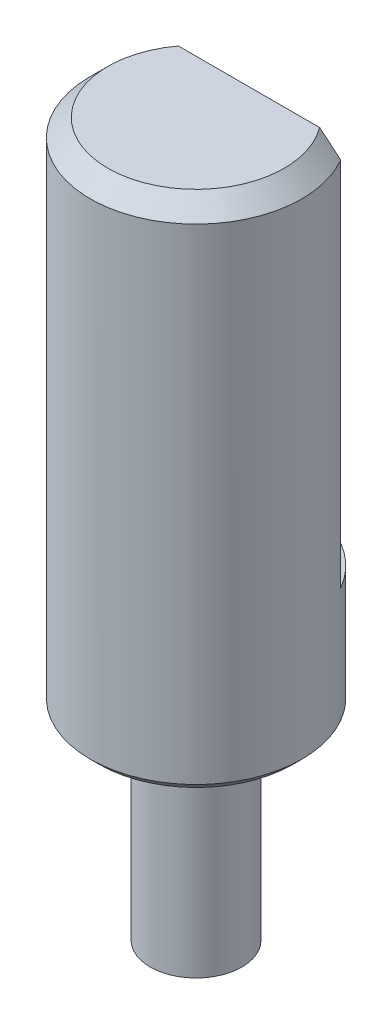
ISO-10303-21;
HEADER;
FILE_DESCRIPTION(('STEP AP214'),'2;1');
FILE_NAME('part.step','',(''),(''),'','','');
FILE_SCHEMA(('AUTOMOTIVE_DESIGN { 1 0 10303 214 1 1 1 1 }'));
ENDSEC;
DATA;
#1=APPLICATION_CONTEXT('core data for automotive mechanical design processes');
#2=APPLICATION_PROTOCOL_DEFINITION('international standard','automotive_design',2000,#1);
#3=PRODUCT_CONTEXT('',#1,'mechanical');
#4=PRODUCT('Part','Part','',(#3));
#5=PRODUCT_RELATED_PRODUCT_CATEGORY('part','',(#4));
#6=PRODUCT_DEFINITION_FORMATION('','',#4);
#7=PRODUCT_DEFINITION_CONTEXT('part definition',#1,'design');
#8=PRODUCT_DEFINITION('design','',#6,#7);
#9=PRODUCT_DEFINITION_SHAPE('','',#8);
#10=(LENGTH_UNIT() NAMED_UNIT(*) SI_UNIT(.MILLI.,.METRE.));
#11=(NAMED_UNIT(*) PLANE_ANGLE_UNIT() SI_UNIT($,.RADIAN.));
#12=(NAMED_UNIT(*) SI_UNIT($,.STERADIAN.) SOLID_ANGLE_UNIT());
#13=UNCERTAINTY_MEASURE_WITH_UNIT(LENGTH_MEASURE(1.E-05),#10,'distance_accuracy_value','');
#14=(GEOMETRIC_REPRESENTATION_CONTEXT(3) GLOBAL_UNCERTAINTY_ASSIGNED_CONTEXT((#13)) GLOBAL_UNIT_ASSIGNED_CONTEXT((#10,
#11,#12)) REPRESENTATION_CONTEXT('',''));
#15=CARTESIAN_POINT('',(0.,0.,0.));
#16=DIRECTION('',(0.,0.,1.));
#17=DIRECTION('',(1.,0.,0.));
#18=AXIS2_PLACEMENT_3D('',#15,#16,#17);
#19=CARTESIAN_POINT('',(0.,5.7,0.));
#20=DIRECTION('',(0.,-1.,0.));
#21=DIRECTION('',(0.,0.,-1.));
#22=AXIS2_PLACEMENT_3D('',#19,#20,#21);
#23=CYLINDRICAL_SURFACE('',#22,1.3);
#24=CARTESIAN_POINT('',(0.,5.7,0.));
#25=DIRECTION('',(0.,1.,0.));
#26=DIRECTION('',(0.,0.,1.));
#27=AXIS2_PLACEMENT_3D('',#24,#25,#26);
#28=CIRCLE('',#27,1.3);
#29=CARTESIAN_POINT('',(0.,5.7,1.3));
#30=VERTEX_POINT('',#29);
#31=EDGE_CURVE('E96',#30,#30,#28,.T.);
#32=ORIENTED_EDGE('',*,*,#31,.F.);
#33=EDGE_LOOP('',(#32));
#34=FACE_BOUND('',#33,.T.);
#35=CARTESIAN_POINT('',(0.,0.,0.));
#36=DIRECTION('',(0.,1.,0.));
#37=DIRECTION('',(0.,0.,1.));
#38=AXIS2_PLACEMENT_3D('',#35,#36,#37);
#39=CIRCLE('',#38,1.3);
#40=CARTESIAN_POINT('',(0.,0.,1.3));
#41=VERTEX_POINT('',#40);
#42=EDGE_CURVE('E92',#41,#41,#39,.T.);
#43=ORIENTED_EDGE('',*,*,#42,.T.);
#44=EDGE_LOOP('',(#43));
#45=FACE_BOUND('',#44,.T.);
#46=ADVANCED_FACE('F44',(#34,#45),#23,.T.);
#47=CARTESIAN_POINT('',(0.,0.,0.));
#48=DIRECTION('',(0.,1.,0.));
#49=DIRECTION('',(0.,0.,1.));
#50=AXIS2_PLACEMENT_3D('',#47,#48,#49);
#51=PLANE('',#50);
#52=ORIENTED_EDGE('',*,*,#42,.F.);
#53=EDGE_LOOP('',(#52));
#54=FACE_BOUND('',#53,.T.);
#55=ADVANCED_FACE('F136',(#54),#51,.F.);
#56=CARTESIAN_POINT('',(0.,20.2,0.));
#57=DIRECTION('',(0.,-1.,0.));
#58=DIRECTION('',(0.,0.,-1.));
#59=AXIS2_PLACEMENT_3D('',#56,#57,#58);
#60=CYLINDRICAL_SURFACE('',#59,3.);
#61=DIRECTION('',(0.,1.,0.));
#62=VECTOR('',#61,1.);
#63=CARTESIAN_POINT('',(2.59807621135332,9.2,-1.5));
#64=LINE('',#63,#62);
#65=CARTESIAN_POINT('',(2.59807621135332,9.2,-1.5));
#66=VERTEX_POINT('',#65);
#67=CARTESIAN_POINT('',(2.59807621135332,19.7,-1.5));
#68=VERTEX_POINT('',#67);
#69=EDGE_CURVE('E87',#66,#68,#64,.T.);
#70=ORIENTED_EDGE('',*,*,#69,.T.);
#71=CARTESIAN_POINT('',(0.,19.7,0.));
#72=DIRECTION('',(0.,1.,0.));
#73=DIRECTION('',(0.,0.,1.));
#74=AXIS2_PLACEMENT_3D('',#71,#72,#73);
#75=CIRCLE('',#74,3.);
#76=CARTESIAN_POINT('',(-2.59807621135332,19.7,-1.5));
#77=VERTEX_POINT('',#76);
#78=EDGE_CURVE('E13',#68,#77,#75,.F.);
#79=ORIENTED_EDGE('',*,*,#78,.T.);
#80=DIRECTION('',(0.,1.,0.));
#81=VECTOR('',#80,1.);
#82=CARTESIAN_POINT('',(-2.59807621135332,9.2,-1.5));
#83=LINE('',#82,#81);
#84=CARTESIAN_POINT('',(-2.59807621135332,9.2,-1.5));
#85=VERTEX_POINT('',#84);
#86=EDGE_CURVE('E85',#85,#77,#83,.T.);
#87=ORIENTED_EDGE('',*,*,#86,.F.);
#88=CARTESIAN_POINT('',(0.,9.2,0.));
#89=DIRECTION('',(0.,1.,0.));
#90=DIRECTION('',(0.,0.,1.));
#91=AXIS2_PLACEMENT_3D('',#88,#89,#90);
#92=CIRCLE('',#91,3.);
#93=EDGE_CURVE('E78',#66,#85,#92,.T.);
#94=ORIENTED_EDGE('',*,*,#93,.F.);
#95=EDGE_LOOP('',(#70,#79,#87,#94));
#96=FACE_BOUND('',#95,.T.);
#97=CARTESIAN_POINT('',(0.,5.95000000000001,0.));
#98=DIRECTION('',(0.,1.,0.));
#99=DIRECTION('',(0.,0.,1.));
#100=AXIS2_PLACEMENT_3D('',#97,#98,#99);
#101=CIRCLE('',#100,3.);
#102=CARTESIAN_POINT('',(0.,5.95000000000001,3.));
#103=VERTEX_POINT('',#102);
#104=EDGE_CURVE('E99',#103,#103,#101,.T.);
#105=ORIENTED_EDGE('',*,*,#104,.T.);
#106=EDGE_LOOP('',(#105));
#107=FACE_BOUND('',#106,.T.);
#108=ADVANCED_FACE('F89',(#96,#107),#60,.T.);
#109=CARTESIAN_POINT('',(0.,20.2,0.));
#110=DIRECTION('',(0.,1.,0.));
#111=DIRECTION('',(0.,0.,1.));
#112=AXIS2_PLACEMENT_3D('',#109,#110,#111);
#113=PLANE('',#112);
#114=DIRECTION('',(1.,0.,0.));
#115=VECTOR('',#114,1.);
#116=CARTESIAN_POINT('',(-2.59807621135332,20.2,-1.5));
#117=LINE('',#116,#115);
#118=CARTESIAN_POINT('',(-2.00000000000001,20.2,-1.5));
#119=VERTEX_POINT('',#118);
#120=CARTESIAN_POINT('',(2.00000000000001,20.2,-1.5));
#121=VERTEX_POINT('',#120);
#122=EDGE_CURVE('E82',#119,#121,#117,.T.);
#123=ORIENTED_EDGE('',*,*,#122,.F.);
#124=CARTESIAN_POINT('',(0.,20.2,0.));
#125=DIRECTION('',(0.,1.,0.));
#126=DIRECTION('',(0.,0.,1.));
#127=AXIS2_PLACEMENT_3D('',#124,#125,#126);
#128=CIRCLE('',#127,2.50000000000001);
#129=EDGE_CURVE('E107',#119,#121,#128,.T.);
#130=ORIENTED_EDGE('',*,*,#129,.T.);
#131=EDGE_LOOP('',(#123,#130));
#132=FACE_BOUND('',#131,.T.);
#133=ADVANCED_FACE('F125',(#132),#113,.T.);
#134=CARTESIAN_POINT('',(0.,5.7,0.));
#135=DIRECTION('',(0.,1.,0.));
#136=DIRECTION('',(0.,0.,1.));
#137=AXIS2_PLACEMENT_3D('',#134,#135,#136);
#138=PLANE('',#137);
#139=CARTESIAN_POINT('',(0.,5.7,0.));
#140=DIRECTION('',(0.,1.,0.));
#141=DIRECTION('',(0.,0.,1.));
#142=AXIS2_PLACEMENT_3D('',#139,#140,#141);
#143=CIRCLE('',#142,2.74999999999999);
#144=CARTESIAN_POINT('',(0.,5.7,2.74999999999999));
#145=VERTEX_POINT('',#144);
#146=EDGE_CURVE('E104',#145,#145,#143,.F.);
#147=ORIENTED_EDGE('',*,*,#146,.T.);
#148=EDGE_LOOP('',(#147));
#149=FACE_BOUND('',#148,.T.);
#150=ORIENTED_EDGE('',*,*,#31,.T.);
#151=EDGE_LOOP('',(#150));
#152=FACE_BOUND('',#151,.T.);
#153=ADVANCED_FACE('F129',(#149,#152),#138,.F.);
#154=CARTESIAN_POINT('',(0.,5.95000000000001,0.));
#155=DIRECTION('',(0.,1.,0.));
#156=DIRECTION('',(0.,0.,1.));
#157=AXIS2_PLACEMENT_3D('',#154,#155,#156);
#158=CONICAL_SURFACE('',#157,3.,0.785398163397448);
#159=ORIENTED_EDGE('',*,*,#146,.F.);
#160=EDGE_LOOP('',(#159));
#161=FACE_BOUND('',#160,.T.);
#162=ORIENTED_EDGE('',*,*,#104,.F.);
#163=EDGE_LOOP('',(#162));
#164=FACE_BOUND('',#163,.T.);
#165=ADVANCED_FACE('F124',(#161,#164),#158,.T.);
#166=CARTESIAN_POINT('',(-2.59807621135332,9.2,-1.5));
#167=DIRECTION('',(0.,0.,1.));
#168=DIRECTION('',(1.,0.,0.));
#169=AXIS2_PLACEMENT_3D('',#166,#167,#168);
#170=PLANE('',#169);
#171=ORIENTED_EDGE('',*,*,#122,.T.);
#172=CARTESIAN_POINT('',(2.00000000000001,20.2,-1.5));
#173=CARTESIAN_POINT('',(2.05073096834371,20.1594091541126,-1.5));
#174=CARTESIAN_POINT('',(2.10119559346293,20.1184877796223,-1.5));
#175=CARTESIAN_POINT('',(2.20165596476533,20.0360826364181,-1.5));
#176=CARTESIAN_POINT('',(2.25165175427951,19.9945989205613,-1.5));
#177=CARTESIAN_POINT('',(2.35124649520412,19.9111611597559,-1.5));
#178=CARTESIAN_POINT('',(2.40084545624944,19.8692071262861,-1.5));
#179=CARTESIAN_POINT('',(2.49970382878964,19.7848914399475,-1.5));
#180=CARTESIAN_POINT('',(2.54896320821956,19.7425297494666,-1.5));
#181=CARTESIAN_POINT('',(2.59807621135341,19.7000000000001,-1.5));
#182=B_SPLINE_CURVE_WITH_KNOTS('',3,(#172,#173,#174,#175,#176,#177,#178,#179,#180,#181),
.UNSPECIFIED.,.F.,.F.,(4,2,2,2,4),(0.,0.194909899355778,0.38980160348904,0.584688561258781,
0.779593675856239),.UNSPECIFIED.);
#183=EDGE_CURVE('E53',#121,#68,#182,.T.);
#184=ORIENTED_EDGE('',*,*,#183,.T.);
#185=ORIENTED_EDGE('',*,*,#69,.F.);
#186=DIRECTION('',(1.,0.,0.));
#187=VECTOR('',#186,1.);
#188=CARTESIAN_POINT('',(-2.59807621135332,9.2,-1.5));
#189=LINE('',#188,#187);
#190=EDGE_CURVE('E81',#85,#66,#189,.T.);
#191=ORIENTED_EDGE('',*,*,#190,.F.);
#192=ORIENTED_EDGE('',*,*,#86,.T.);
#193=CARTESIAN_POINT('',(-2.59807621135332,19.7,-1.5));
#194=CARTESIAN_POINT('',(-2.54896320821952,19.7425297494665,-1.5));
#195=CARTESIAN_POINT('',(-2.49970382878963,19.7848914399475,-1.5));
#196=CARTESIAN_POINT('',(-2.40084545624945,19.8692071262861,-1.5));
#197=CARTESIAN_POINT('',(-2.35124649520413,19.9111611597559,-1.5));
#198=CARTESIAN_POINT('',(-2.2516517542795,19.9945989205613,-1.5));
#199=CARTESIAN_POINT('',(-2.20165596476531,20.036082636418,-1.5));
#200=CARTESIAN_POINT('',(-2.10119559346297,20.1184877796224,-1.5));
#201=CARTESIAN_POINT('',(-2.05073096834384,20.1594091541128,-1.5));
#202=CARTESIAN_POINT('',(-2.00000000000032,20.2000000000004,-1.5));
#203=B_SPLINE_CURVE_WITH_KNOTS('',3,(#193,#194,#195,#196,#197,#198,#199,#200,#201,#202),
.UNSPECIFIED.,.F.,.F.,(4,2,2,2,4),(0.,0.194905114597462,0.389792072367198,0.584683776500454,
0.779593675856229),.UNSPECIFIED.);
#204=EDGE_CURVE('E110',#77,#119,#203,.T.);
#205=ORIENTED_EDGE('',*,*,#204,.T.);
#206=EDGE_LOOP('',(#171,#184,#185,#191,#192,#205));
#207=FACE_BOUND('',#206,.T.);
#208=ADVANCED_FACE('F84',(#207),#170,.F.);
#209=CARTESIAN_POINT('',(0.,9.2,0.));
#210=DIRECTION('',(0.,1.,0.));
#211=DIRECTION('',(0.,0.,1.));
#212=AXIS2_PLACEMENT_3D('',#209,#210,#211);
#213=PLANE('',#212);
#214=ORIENTED_EDGE('',*,*,#93,.T.);
#215=ORIENTED_EDGE('',*,*,#190,.T.);
#216=EDGE_LOOP('',(#214,#215));
#217=FACE_BOUND('',#216,.T.);
#218=ADVANCED_FACE('F80',(#217),#213,.T.);
#219=CARTESIAN_POINT('',(0.,20.2,0.));
#220=DIRECTION('',(0.,-1.,0.));
#221=DIRECTION('',(0.,0.,-1.));
#222=AXIS2_PLACEMENT_3D('',#219,#220,#221);
#223=CONICAL_SURFACE('',#222,2.50000000000001,0.785398163397447);
#224=ORIENTED_EDGE('',*,*,#204,.F.);
#225=ORIENTED_EDGE('',*,*,#78,.F.);
#226=ORIENTED_EDGE('',*,*,#183,.F.);
#227=ORIENTED_EDGE('',*,*,#129,.F.);
#228=EDGE_LOOP('',(#224,#225,#226,#227));
#229=FACE_BOUND('',#228,.T.);
#230=ADVANCED_FACE('F46',(#229),#223,.T.);
#231=CLOSED_SHELL('',(#46,#55,#108,#133,#153,#165,#208,#218,#230));
#232=MANIFOLD_SOLID_BREP('B2',#231);
#233=ADVANCED_BREP_SHAPE_REPRESENTATION('',(#18,#232),#14);
#234=SHAPE_DEFINITION_REPRESENTATION(#9,#233);
ENDSEC;
END-ISO-10303-21;
